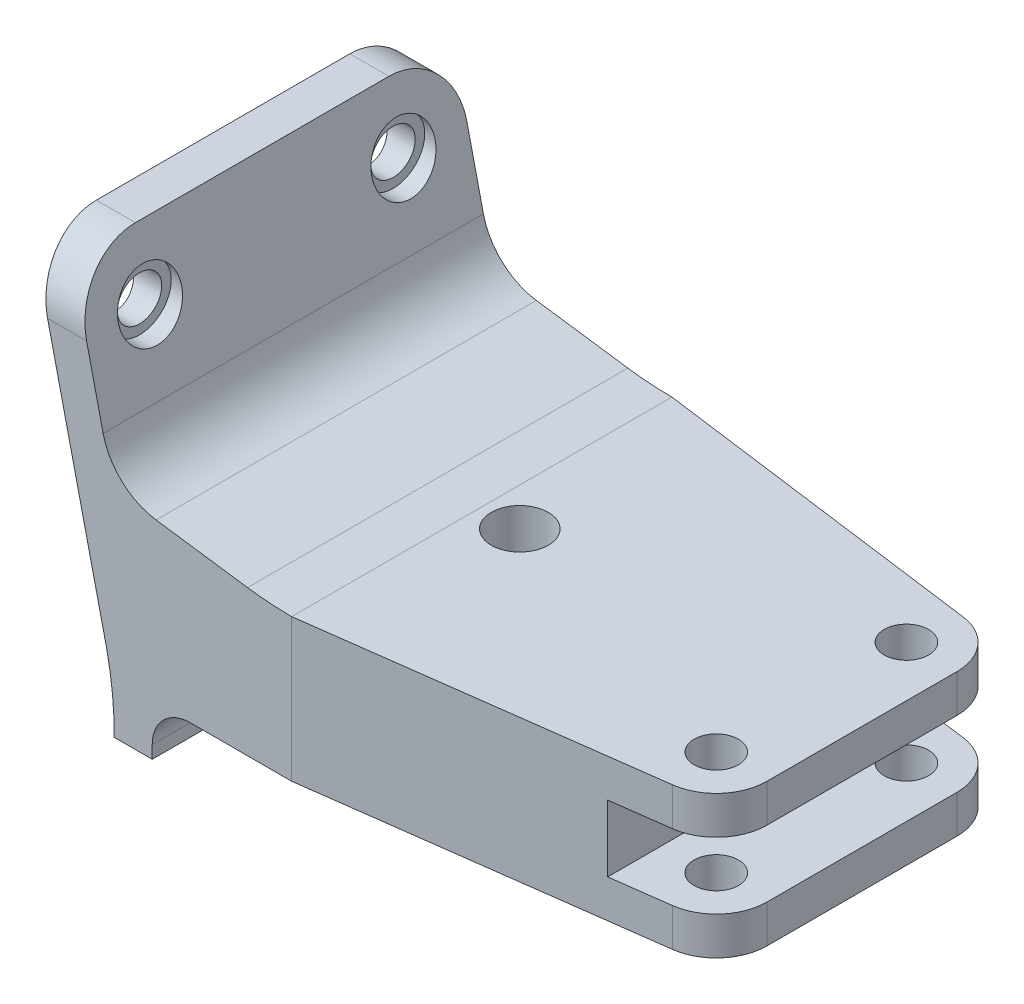
ISO-10303-21;
HEADER;
FILE_DESCRIPTION(('STEP AP214'),'2;1');
FILE_NAME('part.step','',(''),(''),'','','');
FILE_SCHEMA(('AUTOMOTIVE_DESIGN { 1 0 10303 214 1 1 1 1 }'));
ENDSEC;
DATA;
#1=APPLICATION_CONTEXT('core data for automotive mechanical design processes');
#2=APPLICATION_PROTOCOL_DEFINITION('international standard','automotive_design',2000,#1);
#3=PRODUCT_CONTEXT('',#1,'mechanical');
#4=PRODUCT('Part','Part','',(#3));
#5=PRODUCT_RELATED_PRODUCT_CATEGORY('part','',(#4));
#6=PRODUCT_DEFINITION_FORMATION('','',#4);
#7=PRODUCT_DEFINITION_CONTEXT('part definition',#1,'design');
#8=PRODUCT_DEFINITION('design','',#6,#7);
#9=PRODUCT_DEFINITION_SHAPE('','',#8);
#10=(LENGTH_UNIT() NAMED_UNIT(*) SI_UNIT(.MILLI.,.METRE.));
#11=(NAMED_UNIT(*) PLANE_ANGLE_UNIT() SI_UNIT($,.RADIAN.));
#12=(NAMED_UNIT(*) SI_UNIT($,.STERADIAN.) SOLID_ANGLE_UNIT());
#13=UNCERTAINTY_MEASURE_WITH_UNIT(LENGTH_MEASURE(1.E-05),#10,'distance_accuracy_value','');
#14=(GEOMETRIC_REPRESENTATION_CONTEXT(3) GLOBAL_UNCERTAINTY_ASSIGNED_CONTEXT((#13)) GLOBAL_UNIT_ASSIGNED_CONTEXT((#10,
#11,#12)) REPRESENTATION_CONTEXT('',''));
#15=CARTESIAN_POINT('',(0.,0.,0.));
#16=DIRECTION('',(0.,0.,1.));
#17=DIRECTION('',(1.,0.,0.));
#18=AXIS2_PLACEMENT_3D('',#15,#16,#17);
#19=CARTESIAN_POINT('',(19.3601182850422,25.75,10.));
#20=DIRECTION('',(1.,0.,0.));
#21=DIRECTION('',(0.,0.,-1.));
#22=AXIS2_PLACEMENT_3D('',#19,#20,#21);
#23=CYLINDRICAL_SURFACE('',#22,1.75);
#24=CARTESIAN_POINT('',(20.7432435592768,25.75,10.));
#25=DIRECTION('',(0.974444192149769,0.224629731748904,0.));
#26=DIRECTION('',(0.224629731748904,-0.974444192149769,0.));
#27=AXIS2_PLACEMENT_3D('',#24,#25,#26);
#28=ELLIPSE('',#27,1.79589556189897,1.75);
#29=CARTESIAN_POINT('',(21.1466550975952,24.,10.));
#30=VERTEX_POINT('',#29);
#31=EDGE_CURVE('E235',#30,#30,#28,.T.);
#32=ORIENTED_EDGE('',*,*,#31,.F.);
#33=EDGE_LOOP('',(#32));
#34=FACE_BOUND('',#33,.T.);
#35=CARTESIAN_POINT('',(23.,25.75,10.));
#36=DIRECTION('',(1.,0.,0.));
#37=DIRECTION('',(0.,0.,-1.));
#38=AXIS2_PLACEMENT_3D('',#35,#36,#37);
#39=CIRCLE('',#38,1.75);
#40=CARTESIAN_POINT('',(23.,25.75,8.25));
#41=VERTEX_POINT('',#40);
#42=EDGE_CURVE('E422',#41,#41,#39,.F.);
#43=ORIENTED_EDGE('',*,*,#42,.F.);
#44=EDGE_LOOP('',(#43));
#45=FACE_BOUND('',#44,.T.);
#46=ADVANCED_FACE('F33',(#34,#45),#23,.F.);
#47=CARTESIAN_POINT('',(25.1277790392512,20.0851882948513,15.));
#48=DIRECTION('',(-0.974444192149769,-0.224629731748903,0.));
#49=DIRECTION('',(0.224629731748903,-0.974444192149769,0.));
#50=AXIS2_PLACEMENT_3D('',#47,#48,#49);
#51=PLANE('',#50);
#52=CARTESIAN_POINT('',(23.8219216653893,25.75,-10.));
#53=DIRECTION('',(-0.974444192149769,-0.224629731748903,0.));
#54=DIRECTION('',(0.224629731748903,-0.974444192149769,0.));
#55=AXIS2_PLACEMENT_3D('',#52,#53,#54);
#56=ELLIPSE('',#55,2.5655650884271,2.5);
#57=CARTESIAN_POINT('',(24.3982238629871,23.25,-10.));
#58=VERTEX_POINT('',#57);
#59=EDGE_CURVE('E37',#58,#58,#56,.T.);
#60=ORIENTED_EDGE('',*,*,#59,.T.);
#61=EDGE_LOOP('',(#60));
#62=FACE_BOUND('',#61,.T.);
#63=CARTESIAN_POINT('',(23.8219216653893,25.75,10.));
#64=DIRECTION('',(-0.974444192149769,-0.224629731748903,0.));
#65=DIRECTION('',(0.224629731748903,-0.974444192149769,0.));
#66=AXIS2_PLACEMENT_3D('',#63,#64,#65);
#67=ELLIPSE('',#66,2.5655650884271,2.5);
#68=CARTESIAN_POINT('',(24.3982238629871,23.25,10.));
#69=VERTEX_POINT('',#68);
#70=EDGE_CURVE('E425',#69,#69,#67,.T.);
#71=ORIENTED_EDGE('',*,*,#70,.T.);
#72=EDGE_LOOP('',(#71));
#73=FACE_BOUND('',#72,.T.);
#74=DIRECTION('',(-0.224629731748903,0.974444192149769,0.));
#75=VECTOR('',#74,1.);
#76=CARTESIAN_POINT('',(25.1277790392512,20.0851882948513,-15.));
#77=LINE('',#76,#75);
#78=CARTESIAN_POINT('',(25.1277790392512,20.0851882948513,-15.));
#79=VERTEX_POINT('',#78);
#80=CARTESIAN_POINT('',(23.8219216653893,25.75,-15.));
#81=VERTEX_POINT('',#80);
#82=EDGE_CURVE('E364',#79,#81,#77,.T.);
#83=ORIENTED_EDGE('',*,*,#82,.T.);
#84=CARTESIAN_POINT('',(23.8219216653893,25.75,-10.));
#85=DIRECTION('',(-0.974444192149769,-0.224629731748903,0.));
#86=DIRECTION('',(0.224629731748903,-0.974444192149769,0.));
#87=AXIS2_PLACEMENT_3D('',#84,#85,#86);
#88=ELLIPSE('',#87,5.13113017685421,5.);
#89=CARTESIAN_POINT('',(22.6693172701939,30.75,-10.));
#90=VERTEX_POINT('',#89);
#91=EDGE_CURVE('E50',#81,#90,#88,.F.);
#92=ORIENTED_EDGE('',*,*,#91,.T.);
#93=DIRECTION('',(0.,0.,1.));
#94=VECTOR('',#93,1.);
#95=CARTESIAN_POINT('',(22.6693172701939,30.75,15.));
#96=LINE('',#95,#94);
#97=CARTESIAN_POINT('',(22.6693172701939,30.75,10.));
#98=VERTEX_POINT('',#97);
#99=EDGE_CURVE('E209',#90,#98,#96,.T.);
#100=ORIENTED_EDGE('',*,*,#99,.T.);
#101=CARTESIAN_POINT('',(23.8219216653893,25.75,10.));
#102=DIRECTION('',(-0.974444192149769,-0.224629731748903,0.));
#103=DIRECTION('',(0.224629731748903,-0.974444192149769,0.));
#104=AXIS2_PLACEMENT_3D('',#101,#102,#103);
#105=ELLIPSE('',#104,5.13113017685421,5.);
#106=CARTESIAN_POINT('',(23.8219216653893,25.75,15.));
#107=VERTEX_POINT('',#106);
#108=EDGE_CURVE('E220',#98,#107,#105,.F.);
#109=ORIENTED_EDGE('',*,*,#108,.T.);
#110=DIRECTION('',(-0.224629731748903,0.974444192149769,0.));
#111=VECTOR('',#110,1.);
#112=CARTESIAN_POINT('',(25.1277790392512,20.0851882948513,15.));
#113=LINE('',#112,#111);
#114=CARTESIAN_POINT('',(25.1277790392512,20.0851882948513,15.));
#115=VERTEX_POINT('',#114);
#116=EDGE_CURVE('E342',#115,#107,#113,.T.);
#117=ORIENTED_EDGE('',*,*,#116,.F.);
#118=DIRECTION('',(0.,0.,-1.));
#119=VECTOR('',#118,1.);
#120=CARTESIAN_POINT('',(25.1277790392512,20.0851882948513,15.));
#121=LINE('',#120,#119);
#122=EDGE_CURVE('E370',#115,#79,#121,.T.);
#123=ORIENTED_EDGE('',*,*,#122,.T.);
#124=EDGE_LOOP('',(#83,#92,#100,#109,#117,#123));
#125=FACE_BOUND('',#124,.T.);
#126=ADVANCED_FACE('F442',(#62,#73,#125),#51,.F.);
#127=CARTESIAN_POINT('',(0.,0.,15.));
#128=DIRECTION('',(0.,0.,1.));
#129=DIRECTION('',(1.,0.,0.));
#130=AXIS2_PLACEMENT_3D('',#127,#128,#129);
#131=PLANE('',#130);
#132=ORIENTED_EDGE('',*,*,#116,.T.);
#133=DIRECTION('',(1.,0.,0.));
#134=VECTOR('',#133,1.);
#135=CARTESIAN_POINT('',(19.3601182850422,25.75,15.));
#136=LINE('',#135,#134);
#137=CARTESIAN_POINT('',(20.7432435592768,25.75,15.));
#138=VERTEX_POINT('',#137);
#139=EDGE_CURVE('E42',#107,#138,#136,.F.);
#140=ORIENTED_EDGE('',*,*,#139,.T.);
#141=DIRECTION('',(0.224629731748904,-0.974444192149769,0.));
#142=VECTOR('',#141,1.);
#143=CARTESIAN_POINT('',(25.416367975422,5.47797763211434,15.));
#144=LINE('',#143,#142);
#145=CARTESIAN_POINT('',(25.416367975422,5.47797763211434,15.));
#146=VERTEX_POINT('',#145);
#147=EDGE_CURVE('E217',#138,#146,#144,.T.);
#148=ORIENTED_EDGE('',*,*,#147,.T.);
#149=CARTESIAN_POINT('',(0.,0.,15.));
#150=DIRECTION('',(0.,0.,-1.));
#151=DIRECTION('',(1.,0.,0.));
#152=AXIS2_PLACEMENT_3D('',#149,#150,#151);
#153=CIRCLE('',#152,26.);
#154=CARTESIAN_POINT('',(25.9987980491407,-0.25,15.));
#155=VERTEX_POINT('',#154);
#156=EDGE_CURVE('E323',#146,#155,#153,.T.);
#157=ORIENTED_EDGE('',*,*,#156,.T.);
#158=DIRECTION('',(1.,0.,0.));
#159=VECTOR('',#158,1.);
#160=CARTESIAN_POINT('',(25.9987980491407,-0.25,15.));
#161=LINE('',#160,#159);
#162=CARTESIAN_POINT('',(29.,-0.25,15.));
#163=VERTEX_POINT('',#162);
#164=EDGE_CURVE('E326',#155,#163,#161,.T.);
#165=ORIENTED_EDGE('',*,*,#164,.T.);
#166=DIRECTION('',(0.,1.,0.));
#167=VECTOR('',#166,1.);
#168=CARTESIAN_POINT('',(29.,0.749999999999999,15.));
#169=LINE('',#168,#167);
#170=CARTESIAN_POINT('',(29.,0.75,15.));
#171=VERTEX_POINT('',#170);
#172=EDGE_CURVE('E329',#163,#171,#169,.T.);
#173=ORIENTED_EDGE('',*,*,#172,.T.);
#174=CARTESIAN_POINT('',(32.,0.75,15.));
#175=DIRECTION('',(0.,0.,-1.));
#176=DIRECTION('',(1.,0.,0.));
#177=AXIS2_PLACEMENT_3D('',#174,#175,#176);
#178=CIRCLE('',#177,3.);
#179=CARTESIAN_POINT('',(32.,3.75,15.));
#180=VERTEX_POINT('',#179);
#181=EDGE_CURVE('E331',#171,#180,#178,.T.);
#182=ORIENTED_EDGE('',*,*,#181,.T.);
#183=DIRECTION('',(1.,0.,0.));
#184=VECTOR('',#183,1.);
#185=CARTESIAN_POINT('',(32.,3.75,15.));
#186=LINE('',#185,#184);
#187=CARTESIAN_POINT('',(40.,3.75,15.));
#188=VERTEX_POINT('',#187);
#189=EDGE_CURVE('E333',#180,#188,#186,.T.);
#190=ORIENTED_EDGE('',*,*,#189,.T.);
#191=DIRECTION('',(0.,-1.,0.));
#192=VECTOR('',#191,1.);
#193=CARTESIAN_POINT('',(40.,0.,15.));
#194=LINE('',#193,#192);
#195=CARTESIAN_POINT('',(40.,15.,15.));
#196=VERTEX_POINT('',#195);
#197=EDGE_CURVE('E414',#196,#188,#194,.T.);
#198=ORIENTED_EDGE('',*,*,#197,.F.);
#199=CARTESIAN_POINT('',(40.,40.,15.));
#200=DIRECTION('',(0.,0.,-1.));
#201=DIRECTION('',(1.,0.,0.));
#202=AXIS2_PLACEMENT_3D('',#199,#200,#201);
#203=CIRCLE('',#202,25.);
#204=CARTESIAN_POINT('',(36.5224214750842,15.2430525386702,15.));
#205=VERTEX_POINT('',#204);
#206=EDGE_CURVE('E336',#196,#205,#203,.T.);
#207=ORIENTED_EDGE('',*,*,#206,.T.);
#208=DIRECTION('',(-0.990277898453192,0.13910314099663,0.));
#209=VECTOR('',#208,1.);
#210=CARTESIAN_POINT('',(29.3044842950168,16.2569474613298,15.));
#211=LINE('',#210,#209);
#212=CARTESIAN_POINT('',(29.3044842950168,16.2569474613298,15.));
#213=VERTEX_POINT('',#212);
#214=EDGE_CURVE('E338',#205,#213,#211,.T.);
#215=ORIENTED_EDGE('',*,*,#214,.T.);
#216=CARTESIAN_POINT('',(30.,21.2083369535958,15.));
#217=DIRECTION('',(0.,0.,-1.));
#218=DIRECTION('',(-1.,0.,0.));
#219=AXIS2_PLACEMENT_3D('',#216,#217,#218);
#220=CIRCLE('',#219,5.);
#221=EDGE_CURVE('E340',#213,#115,#220,.T.);
#222=ORIENTED_EDGE('',*,*,#221,.T.);
#223=EDGE_LOOP('',(#132,#140,#148,#157,#165,#173,#182,#190,#198,#207,#215,#222));
#224=FACE_BOUND('',#223,.T.);
#225=ADVANCED_FACE('F455',(#224),#131,.T.);
#226=CARTESIAN_POINT('',(0.,0.,-15.));
#227=DIRECTION('',(0.,0.,1.));
#228=DIRECTION('',(1.,0.,0.));
#229=AXIS2_PLACEMENT_3D('',#226,#227,#228);
#230=PLANE('',#229);
#231=DIRECTION('',(1.,0.,0.));
#232=VECTOR('',#231,1.);
#233=CARTESIAN_POINT('',(19.3601182850422,25.75,-15.));
#234=LINE('',#233,#232);
#235=CARTESIAN_POINT('',(20.7432435592768,25.75,-15.));
#236=VERTEX_POINT('',#235);
#237=EDGE_CURVE('E200',#81,#236,#234,.F.);
#238=ORIENTED_EDGE('',*,*,#237,.F.);
#239=ORIENTED_EDGE('',*,*,#82,.F.);
#240=CARTESIAN_POINT('',(30.,21.2083369535958,-15.));
#241=DIRECTION('',(0.,0.,-1.));
#242=DIRECTION('',(-1.,0.,0.));
#243=AXIS2_PLACEMENT_3D('',#240,#241,#242);
#244=CIRCLE('',#243,5.);
#245=CARTESIAN_POINT('',(29.3044842950168,16.2569474613298,-15.));
#246=VERTEX_POINT('',#245);
#247=EDGE_CURVE('E362',#246,#79,#244,.T.);
#248=ORIENTED_EDGE('',*,*,#247,.F.);
#249=DIRECTION('',(-0.990277898453192,0.13910314099663,0.));
#250=VECTOR('',#249,1.);
#251=CARTESIAN_POINT('',(29.3044842950168,16.2569474613298,-15.));
#252=LINE('',#251,#250);
#253=CARTESIAN_POINT('',(36.5224214750842,15.2430525386702,-15.));
#254=VERTEX_POINT('',#253);
#255=EDGE_CURVE('E360',#254,#246,#252,.T.);
#256=ORIENTED_EDGE('',*,*,#255,.F.);
#257=CARTESIAN_POINT('',(40.,40.,-15.));
#258=DIRECTION('',(0.,0.,-1.));
#259=DIRECTION('',(1.,0.,0.));
#260=AXIS2_PLACEMENT_3D('',#257,#258,#259);
#261=CIRCLE('',#260,25.);
#262=CARTESIAN_POINT('',(40.,15.,-15.));
#263=VERTEX_POINT('',#262);
#264=EDGE_CURVE('E358',#263,#254,#261,.T.);
#265=ORIENTED_EDGE('',*,*,#264,.F.);
#266=DIRECTION('',(0.,-1.,0.));
#267=VECTOR('',#266,1.);
#268=CARTESIAN_POINT('',(40.,0.,-15.));
#269=LINE('',#268,#267);
#270=CARTESIAN_POINT('',(40.,3.75,-15.));
#271=VERTEX_POINT('',#270);
#272=EDGE_CURVE('E412',#263,#271,#269,.T.);
#273=ORIENTED_EDGE('',*,*,#272,.T.);
#274=DIRECTION('',(1.,0.,0.));
#275=VECTOR('',#274,1.);
#276=CARTESIAN_POINT('',(32.,3.75,-15.));
#277=LINE('',#276,#275);
#278=CARTESIAN_POINT('',(32.,3.75,-15.));
#279=VERTEX_POINT('',#278);
#280=EDGE_CURVE('E355',#279,#271,#277,.T.);
#281=ORIENTED_EDGE('',*,*,#280,.F.);
#282=CARTESIAN_POINT('',(32.,0.75,-15.));
#283=DIRECTION('',(0.,0.,-1.));
#284=DIRECTION('',(1.,0.,0.));
#285=AXIS2_PLACEMENT_3D('',#282,#283,#284);
#286=CIRCLE('',#285,3.);
#287=CARTESIAN_POINT('',(29.,0.75,-15.));
#288=VERTEX_POINT('',#287);
#289=EDGE_CURVE('E353',#288,#279,#286,.T.);
#290=ORIENTED_EDGE('',*,*,#289,.F.);
#291=DIRECTION('',(0.,1.,0.));
#292=VECTOR('',#291,1.);
#293=CARTESIAN_POINT('',(29.,0.749999999999999,-15.));
#294=LINE('',#293,#292);
#295=CARTESIAN_POINT('',(29.,-0.25,-15.));
#296=VERTEX_POINT('',#295);
#297=EDGE_CURVE('E351',#296,#288,#294,.T.);
#298=ORIENTED_EDGE('',*,*,#297,.F.);
#299=DIRECTION('',(1.,0.,0.));
#300=VECTOR('',#299,1.);
#301=CARTESIAN_POINT('',(25.9987980491407,-0.25,-15.));
#302=LINE('',#301,#300);
#303=CARTESIAN_POINT('',(25.9987980491407,-0.25,-15.));
#304=VERTEX_POINT('',#303);
#305=EDGE_CURVE('E349',#304,#296,#302,.T.);
#306=ORIENTED_EDGE('',*,*,#305,.F.);
#307=CARTESIAN_POINT('',(0.,0.,-15.));
#308=DIRECTION('',(0.,0.,-1.));
#309=DIRECTION('',(1.,0.,0.));
#310=AXIS2_PLACEMENT_3D('',#307,#308,#309);
#311=CIRCLE('',#310,26.);
#312=CARTESIAN_POINT('',(25.416367975422,5.47797763211434,-15.));
#313=VERTEX_POINT('',#312);
#314=EDGE_CURVE('E322',#313,#304,#311,.T.);
#315=ORIENTED_EDGE('',*,*,#314,.F.);
#316=DIRECTION('',(0.224629731748904,-0.974444192149769,0.));
#317=VECTOR('',#316,1.);
#318=CARTESIAN_POINT('',(25.416367975422,5.47797763211434,-15.));
#319=LINE('',#318,#317);
#320=EDGE_CURVE('E327',#236,#313,#319,.T.);
#321=ORIENTED_EDGE('',*,*,#320,.F.);
#322=EDGE_LOOP('',(#238,#239,#248,#256,#265,#273,#281,#290,#298,#306,#315,#321));
#323=FACE_BOUND('',#322,.T.);
#324=ADVANCED_FACE('F448',(#323),#230,.F.);
#325=CARTESIAN_POINT('',(70.,3.75,15.));
#326=DIRECTION('',(-1.,0.,0.));
#327=DIRECTION('',(0.,0.,1.));
#328=AXIS2_PLACEMENT_3D('',#325,#326,#327);
#329=PLANE('',#328);
#330=DIRECTION('',(0.,1.,0.));
#331=VECTOR('',#330,1.);
#332=CARTESIAN_POINT('',(70.,-0.25,-7.5));
#333=LINE('',#332,#331);
#334=CARTESIAN_POINT('',(70.,3.75,-7.5));
#335=VERTEX_POINT('',#334);
#336=CARTESIAN_POINT('',(70.,6.75,-7.5));
#337=VERTEX_POINT('',#336);
#338=EDGE_CURVE('E255',#335,#337,#333,.T.);
#339=ORIENTED_EDGE('',*,*,#338,.T.);
#340=DIRECTION('',(0.,0.,-1.));
#341=VECTOR('',#340,1.);
#342=CARTESIAN_POINT('',(70.,6.75,15.));
#343=LINE('',#342,#341);
#344=CARTESIAN_POINT('',(70.,6.75,7.5));
#345=VERTEX_POINT('',#344);
#346=EDGE_CURVE('E394',#345,#337,#343,.T.);
#347=ORIENTED_EDGE('',*,*,#346,.F.);
#348=DIRECTION('',(0.,1.,0.));
#349=VECTOR('',#348,1.);
#350=CARTESIAN_POINT('',(70.,-0.25,7.5));
#351=LINE('',#350,#349);
#352=CARTESIAN_POINT('',(70.,3.75,7.5));
#353=VERTEX_POINT('',#352);
#354=EDGE_CURVE('E245',#353,#345,#351,.T.);
#355=ORIENTED_EDGE('',*,*,#354,.F.);
#356=DIRECTION('',(0.,0.,-1.));
#357=VECTOR('',#356,1.);
#358=CARTESIAN_POINT('',(70.,3.75,15.));
#359=LINE('',#358,#357);
#360=EDGE_CURVE('E397',#353,#335,#359,.T.);
#361=ORIENTED_EDGE('',*,*,#360,.T.);
#362=EDGE_LOOP('',(#339,#347,#355,#361));
#363=FACE_BOUND('',#362,.T.);
#364=ADVANCED_FACE('F513',(#363),#329,.F.);
#365=CARTESIAN_POINT('',(70.,15.,15.));
#366=DIRECTION('',(-1.,0.,0.));
#367=DIRECTION('',(0.,0.,1.));
#368=AXIS2_PLACEMENT_3D('',#365,#366,#367);
#369=PLANE('',#368);
#370=CARTESIAN_POINT('',(70.,12.,-7.5));
#371=VERTEX_POINT('',#370);
#372=CARTESIAN_POINT('',(70.,15.,-7.5));
#373=VERTEX_POINT('',#372);
#374=EDGE_CURVE('E252',#371,#373,#333,.T.);
#375=ORIENTED_EDGE('',*,*,#374,.T.);
#376=DIRECTION('',(0.,0.,-1.));
#377=VECTOR('',#376,1.);
#378=CARTESIAN_POINT('',(70.,15.,15.));
#379=LINE('',#378,#377);
#380=CARTESIAN_POINT('',(70.,15.,7.5));
#381=VERTEX_POINT('',#380);
#382=EDGE_CURVE('E382',#381,#373,#379,.T.);
#383=ORIENTED_EDGE('',*,*,#382,.F.);
#384=CARTESIAN_POINT('',(70.,12.,7.5));
#385=VERTEX_POINT('',#384);
#386=EDGE_CURVE('E243',#385,#381,#351,.T.);
#387=ORIENTED_EDGE('',*,*,#386,.F.);
#388=DIRECTION('',(0.,0.,-1.));
#389=VECTOR('',#388,1.);
#390=CARTESIAN_POINT('',(70.,12.,15.));
#391=LINE('',#390,#389);
#392=EDGE_CURVE('E385',#385,#371,#391,.T.);
#393=ORIENTED_EDGE('',*,*,#392,.T.);
#394=EDGE_LOOP('',(#375,#383,#387,#393));
#395=FACE_BOUND('',#394,.T.);
#396=ADVANCED_FACE('F534',(#395),#369,.F.);
#397=CARTESIAN_POINT('',(0.,0.,15.));
#398=DIRECTION('',(0.,0.,-1.));
#399=DIRECTION('',(-1.,0.,0.));
#400=AXIS2_PLACEMENT_3D('',#397,#398,#399);
#401=CYLINDRICAL_SURFACE('',#400,26.);
#402=ORIENTED_EDGE('',*,*,#314,.T.);
#403=DIRECTION('',(0.,0.,-1.));
#404=VECTOR('',#403,1.);
#405=CARTESIAN_POINT('',(25.9987980491407,-0.25,15.));
#406=LINE('',#405,#404);
#407=EDGE_CURVE('E409',#155,#304,#406,.T.);
#408=ORIENTED_EDGE('',*,*,#407,.F.);
#409=ORIENTED_EDGE('',*,*,#156,.F.);
#410=DIRECTION('',(0.,0.,-1.));
#411=VECTOR('',#410,1.);
#412=CARTESIAN_POINT('',(25.416367975422,5.47797763211434,15.));
#413=LINE('',#412,#411);
#414=EDGE_CURVE('E346',#146,#313,#413,.T.);
#415=ORIENTED_EDGE('',*,*,#414,.T.);
#416=EDGE_LOOP('',(#402,#408,#409,#415));
#417=FACE_BOUND('',#416,.T.);
#418=ADVANCED_FACE('F35',(#417),#401,.F.);
#419=CARTESIAN_POINT('',(25.9987980491407,-0.25,15.));
#420=DIRECTION('',(0.,1.,0.));
#421=DIRECTION('',(0.,0.,1.));
#422=AXIS2_PLACEMENT_3D('',#419,#420,#421);
#423=PLANE('',#422);
#424=ORIENTED_EDGE('',*,*,#305,.T.);
#425=DIRECTION('',(0.,0.,-1.));
#426=VECTOR('',#425,1.);
#427=CARTESIAN_POINT('',(29.,-0.25,15.));
#428=LINE('',#427,#426);
#429=EDGE_CURVE('E406',#163,#296,#428,.T.);
#430=ORIENTED_EDGE('',*,*,#429,.F.);
#431=ORIENTED_EDGE('',*,*,#164,.F.);
#432=ORIENTED_EDGE('',*,*,#407,.T.);
#433=EDGE_LOOP('',(#424,#430,#431,#432));
#434=FACE_BOUND('',#433,.T.);
#435=ADVANCED_FACE('F562',(#434),#423,.F.);
#436=CARTESIAN_POINT('',(29.,0.749999999999999,15.));
#437=DIRECTION('',(-1.,0.,0.));
#438=DIRECTION('',(0.,0.,1.));
#439=AXIS2_PLACEMENT_3D('',#436,#437,#438);
#440=PLANE('',#439);
#441=ORIENTED_EDGE('',*,*,#297,.T.);
#442=DIRECTION('',(0.,0.,-1.));
#443=VECTOR('',#442,1.);
#444=CARTESIAN_POINT('',(29.,0.75,15.));
#445=LINE('',#444,#443);
#446=EDGE_CURVE('E403',#171,#288,#445,.T.);
#447=ORIENTED_EDGE('',*,*,#446,.F.);
#448=ORIENTED_EDGE('',*,*,#172,.F.);
#449=ORIENTED_EDGE('',*,*,#429,.T.);
#450=EDGE_LOOP('',(#441,#447,#448,#449));
#451=FACE_BOUND('',#450,.T.);
#452=ADVANCED_FACE('F559',(#451),#440,.F.);
#453=CARTESIAN_POINT('',(32.,0.75,15.));
#454=DIRECTION('',(0.,0.,-1.));
#455=DIRECTION('',(-1.,0.,0.));
#456=AXIS2_PLACEMENT_3D('',#453,#454,#455);
#457=CYLINDRICAL_SURFACE('',#456,3.);
#458=ORIENTED_EDGE('',*,*,#289,.T.);
#459=DIRECTION('',(0.,0.,-1.));
#460=VECTOR('',#459,1.);
#461=CARTESIAN_POINT('',(32.,3.75,15.));
#462=LINE('',#461,#460);
#463=EDGE_CURVE('E400',#180,#279,#462,.T.);
#464=ORIENTED_EDGE('',*,*,#463,.F.);
#465=ORIENTED_EDGE('',*,*,#181,.F.);
#466=ORIENTED_EDGE('',*,*,#446,.T.);
#467=EDGE_LOOP('',(#458,#464,#465,#466));
#468=FACE_BOUND('',#467,.T.);
#469=ADVANCED_FACE('F555',(#468),#457,.F.);
#470=CARTESIAN_POINT('',(32.,3.75,15.));
#471=DIRECTION('',(0.,1.,0.));
#472=DIRECTION('',(0.,0.,1.));
#473=AXIS2_PLACEMENT_3D('',#470,#471,#472);
#474=PLANE('',#473);
#475=CARTESIAN_POINT('',(43.,3.75,0.));
#476=DIRECTION('',(0.,1.,0.));
#477=DIRECTION('',(0.,0.,1.));
#478=AXIS2_PLACEMENT_3D('',#475,#476,#477);
#479=CIRCLE('',#478,2.25000000000002);
#480=CARTESIAN_POINT('',(43.,3.75,2.25000000000002));
#481=VERTEX_POINT('',#480);
#482=EDGE_CURVE('E307',#481,#481,#479,.T.);
#483=ORIENTED_EDGE('',*,*,#482,.T.);
#484=EDGE_LOOP('',(#483));
#485=FACE_BOUND('',#484,.T.);
#486=CARTESIAN_POINT('',(66.,3.75,7.5));
#487=DIRECTION('',(0.,1.,0.));
#488=DIRECTION('',(0.,0.,1.));
#489=AXIS2_PLACEMENT_3D('',#486,#487,#488);
#490=CIRCLE('',#489,1.75);
#491=CARTESIAN_POINT('',(66.,3.75,9.25));
#492=VERTEX_POINT('',#491);
#493=EDGE_CURVE('E304',#492,#492,#490,.T.);
#494=ORIENTED_EDGE('',*,*,#493,.T.);
#495=EDGE_LOOP('',(#494));
#496=FACE_BOUND('',#495,.T.);
#497=CARTESIAN_POINT('',(66.,3.75,-7.5));
#498=DIRECTION('',(0.,1.,0.));
#499=DIRECTION('',(0.,0.,1.));
#500=AXIS2_PLACEMENT_3D('',#497,#498,#499);
#501=CIRCLE('',#500,1.75);
#502=CARTESIAN_POINT('',(66.,3.75,-5.75));
#503=VERTEX_POINT('',#502);
#504=EDGE_CURVE('E319',#503,#503,#501,.T.);
#505=ORIENTED_EDGE('',*,*,#504,.T.);
#506=EDGE_LOOP('',(#505));
#507=FACE_BOUND('',#506,.T.);
#508=DIRECTION('',(0.991238008789044,0.,0.132087887150686));
#509=VECTOR('',#508,1.);
#510=CARTESIAN_POINT('',(36.0674937067874,3.75,-15.5240279759972));
#511=LINE('',#510,#509);
#512=CARTESIAN_POINT('',(66.5283515486027,3.75,-11.4649520351562));
#513=VERTEX_POINT('',#512);
#514=EDGE_CURVE('E58',#271,#513,#511,.T.);
#515=ORIENTED_EDGE('',*,*,#514,.T.);
#516=CARTESIAN_POINT('',(66.,3.75,-7.5));
#517=DIRECTION('',(0.,1.,0.));
#518=DIRECTION('',(0.,0.,1.));
#519=AXIS2_PLACEMENT_3D('',#516,#517,#518);
#520=CIRCLE('',#519,4.);
#521=EDGE_CURVE('E295',#513,#335,#520,.F.);
#522=ORIENTED_EDGE('',*,*,#521,.T.);
#523=ORIENTED_EDGE('',*,*,#360,.F.);
#524=CARTESIAN_POINT('',(66.,3.75,7.5));
#525=DIRECTION('',(0.,1.,0.));
#526=DIRECTION('',(0.,0.,1.));
#527=AXIS2_PLACEMENT_3D('',#524,#525,#526);
#528=CIRCLE('',#527,4.);
#529=CARTESIAN_POINT('',(66.5283515486027,3.75,11.4649520351562));
#530=VERTEX_POINT('',#529);
#531=EDGE_CURVE('E286',#353,#530,#528,.F.);
#532=ORIENTED_EDGE('',*,*,#531,.T.);
#533=DIRECTION('',(-0.991238008789044,0.,0.132087887150686));
#534=VECTOR('',#533,1.);
#535=CARTESIAN_POINT('',(32.1395776794554,3.75,16.0474442739552));
#536=LINE('',#535,#534);
#537=EDGE_CURVE('E277',#530,#188,#536,.T.);
#538=ORIENTED_EDGE('',*,*,#537,.T.);
#539=ORIENTED_EDGE('',*,*,#189,.F.);
#540=ORIENTED_EDGE('',*,*,#463,.T.);
#541=ORIENTED_EDGE('',*,*,#280,.T.);
#542=EDGE_LOOP('',(#515,#522,#523,#532,#538,#539,#540,#541));
#543=FACE_BOUND('',#542,.T.);
#544=ADVANCED_FACE('F548',(#485,#496,#507,#543),#474,.F.);
#545=CARTESIAN_POINT('',(70.,6.75,15.));
#546=DIRECTION('',(0.,-1.,0.));
#547=DIRECTION('',(0.,0.,-1.));
#548=AXIS2_PLACEMENT_3D('',#545,#546,#547);
#549=PLANE('',#548);
#550=CARTESIAN_POINT('',(66.,6.75,7.5));
#551=DIRECTION('',(0.,-1.,0.));
#552=DIRECTION('',(0.,0.,-1.));
#553=AXIS2_PLACEMENT_3D('',#550,#551,#552);
#554=CIRCLE('',#553,1.75);
#555=CARTESIAN_POINT('',(66.,6.75,5.75));
#556=VERTEX_POINT('',#555);
#557=EDGE_CURVE('E301',#556,#556,#554,.T.);
#558=ORIENTED_EDGE('',*,*,#557,.T.);
#559=EDGE_LOOP('',(#558));
#560=FACE_BOUND('',#559,.T.);
#561=CARTESIAN_POINT('',(66.,6.75,-7.5));
#562=DIRECTION('',(0.,-1.,0.));
#563=DIRECTION('',(0.,0.,-1.));
#564=AXIS2_PLACEMENT_3D('',#561,#562,#563);
#565=CIRCLE('',#564,1.75);
#566=CARTESIAN_POINT('',(66.,6.75,-9.25));
#567=VERTEX_POINT('',#566);
#568=EDGE_CURVE('E316',#567,#567,#565,.T.);
#569=ORIENTED_EDGE('',*,*,#568,.T.);
#570=EDGE_LOOP('',(#569));
#571=FACE_BOUND('',#570,.T.);
#572=ORIENTED_EDGE('',*,*,#346,.T.);
#573=CARTESIAN_POINT('',(66.,6.75,-7.5));
#574=DIRECTION('',(0.,-1.,0.));
#575=DIRECTION('',(0.,0.,-1.));
#576=AXIS2_PLACEMENT_3D('',#573,#574,#575);
#577=CIRCLE('',#576,4.);
#578=CARTESIAN_POINT('',(66.5283515486027,6.75,-11.4649520351562));
#579=VERTEX_POINT('',#578);
#580=EDGE_CURVE('E292',#337,#579,#577,.F.);
#581=ORIENTED_EDGE('',*,*,#580,.T.);
#582=DIRECTION('',(-0.991238008789044,0.,-0.132087887150686));
#583=VECTOR('',#582,1.);
#584=CARTESIAN_POINT('',(73.404499729374,6.75,-10.5486676747101));
#585=LINE('',#584,#583);
#586=CARTESIAN_POINT('',(62.,6.75,-12.0683796509527));
#587=VERTEX_POINT('',#586);
#588=EDGE_CURVE('E264',#579,#587,#585,.T.);
#589=ORIENTED_EDGE('',*,*,#588,.T.);
#590=DIRECTION('',(0.,0.,-1.));
#591=VECTOR('',#590,1.);
#592=CARTESIAN_POINT('',(62.,6.75,15.));
#593=LINE('',#592,#591);
#594=CARTESIAN_POINT('',(62.,6.75,12.0683796509527));
#595=VERTEX_POINT('',#594);
#596=EDGE_CURVE('E391',#595,#587,#593,.T.);
#597=ORIENTED_EDGE('',*,*,#596,.F.);
#598=DIRECTION('',(0.991238008789044,0.,-0.132087887150686));
#599=VECTOR('',#598,1.);
#600=CARTESIAN_POINT('',(69.476583702042,6.75,11.0720839726681));
#601=LINE('',#600,#599);
#602=CARTESIAN_POINT('',(66.5283515486027,6.75,11.4649520351562));
#603=VERTEX_POINT('',#602);
#604=EDGE_CURVE('E274',#595,#603,#601,.T.);
#605=ORIENTED_EDGE('',*,*,#604,.T.);
#606=CARTESIAN_POINT('',(66.,6.75,7.5));
#607=DIRECTION('',(0.,-1.,0.));
#608=DIRECTION('',(0.,0.,-1.));
#609=AXIS2_PLACEMENT_3D('',#606,#607,#608);
#610=CIRCLE('',#609,4.);
#611=EDGE_CURVE('E283',#603,#345,#610,.F.);
#612=ORIENTED_EDGE('',*,*,#611,.T.);
#613=EDGE_LOOP('',(#572,#581,#589,#597,#605,#612));
#614=FACE_BOUND('',#613,.T.);
#615=ADVANCED_FACE('F544',(#560,#571,#614),#549,.F.);
#616=CARTESIAN_POINT('',(62.,12.,15.));
#617=DIRECTION('',(-1.,0.,0.));
#618=DIRECTION('',(0.,0.,1.));
#619=AXIS2_PLACEMENT_3D('',#616,#617,#618);
#620=PLANE('',#619);
#621=ORIENTED_EDGE('',*,*,#596,.T.);
#622=DIRECTION('',(0.,1.,0.));
#623=VECTOR('',#622,1.);
#624=CARTESIAN_POINT('',(62.,12.,-12.0683796509527));
#625=LINE('',#624,#623);
#626=CARTESIAN_POINT('',(62.,12.,-12.0683796509527));
#627=VERTEX_POINT('',#626);
#628=EDGE_CURVE('E261',#587,#627,#625,.T.);
#629=ORIENTED_EDGE('',*,*,#628,.T.);
#630=DIRECTION('',(0.,0.,-1.));
#631=VECTOR('',#630,1.);
#632=CARTESIAN_POINT('',(62.,12.,15.));
#633=LINE('',#632,#631);
#634=CARTESIAN_POINT('',(62.,12.,12.0683796509527));
#635=VERTEX_POINT('',#634);
#636=EDGE_CURVE('E388',#635,#627,#633,.T.);
#637=ORIENTED_EDGE('',*,*,#636,.F.);
#638=DIRECTION('',(0.,-1.,0.));
#639=VECTOR('',#638,1.);
#640=CARTESIAN_POINT('',(62.,12.,12.0683796509527));
#641=LINE('',#640,#639);
#642=EDGE_CURVE('E271',#635,#595,#641,.T.);
#643=ORIENTED_EDGE('',*,*,#642,.T.);
#644=EDGE_LOOP('',(#621,#629,#637,#643));
#645=FACE_BOUND('',#644,.T.);
#646=ADVANCED_FACE('F540',(#645),#620,.F.);
#647=CARTESIAN_POINT('',(70.,12.,15.));
#648=DIRECTION('',(0.,1.,0.));
#649=DIRECTION('',(0.,0.,1.));
#650=AXIS2_PLACEMENT_3D('',#647,#648,#649);
#651=PLANE('',#650);
#652=CARTESIAN_POINT('',(66.,12.,7.5));
#653=DIRECTION('',(0.,1.,0.));
#654=DIRECTION('',(0.,0.,1.));
#655=AXIS2_PLACEMENT_3D('',#652,#653,#654);
#656=CIRCLE('',#655,1.75);
#657=CARTESIAN_POINT('',(66.,12.,9.25));
#658=VERTEX_POINT('',#657);
#659=EDGE_CURVE('E298',#658,#658,#656,.T.);
#660=ORIENTED_EDGE('',*,*,#659,.T.);
#661=EDGE_LOOP('',(#660));
#662=FACE_BOUND('',#661,.T.);
#663=CARTESIAN_POINT('',(66.,12.,-7.5));
#664=DIRECTION('',(0.,1.,0.));
#665=DIRECTION('',(0.,0.,1.));
#666=AXIS2_PLACEMENT_3D('',#663,#664,#665);
#667=CIRCLE('',#666,1.75);
#668=CARTESIAN_POINT('',(66.,12.,-5.75));
#669=VERTEX_POINT('',#668);
#670=EDGE_CURVE('E313',#669,#669,#667,.T.);
#671=ORIENTED_EDGE('',*,*,#670,.T.);
#672=EDGE_LOOP('',(#671));
#673=FACE_BOUND('',#672,.T.);
#674=DIRECTION('',(0.991238008789044,0.,0.132087887150686));
#675=VECTOR('',#674,1.);
#676=CARTESIAN_POINT('',(73.404499729374,12.,-10.5486676747101));
#677=LINE('',#676,#675);
#678=CARTESIAN_POINT('',(66.5283515486027,12.,-11.4649520351562));
#679=VERTEX_POINT('',#678);
#680=EDGE_CURVE('E258',#627,#679,#677,.T.);
#681=ORIENTED_EDGE('',*,*,#680,.T.);
#682=CARTESIAN_POINT('',(66.,12.,-7.5));
#683=DIRECTION('',(0.,1.,0.));
#684=DIRECTION('',(0.,0.,1.));
#685=AXIS2_PLACEMENT_3D('',#682,#683,#684);
#686=CIRCLE('',#685,4.);
#687=EDGE_CURVE('E289',#679,#371,#686,.F.);
#688=ORIENTED_EDGE('',*,*,#687,.T.);
#689=ORIENTED_EDGE('',*,*,#392,.F.);
#690=CARTESIAN_POINT('',(66.,12.,7.5));
#691=DIRECTION('',(0.,1.,0.));
#692=DIRECTION('',(0.,0.,1.));
#693=AXIS2_PLACEMENT_3D('',#690,#691,#692);
#694=CIRCLE('',#693,4.);
#695=CARTESIAN_POINT('',(66.5283515486027,12.,11.4649520351562));
#696=VERTEX_POINT('',#695);
#697=EDGE_CURVE('E280',#385,#696,#694,.F.);
#698=ORIENTED_EDGE('',*,*,#697,.T.);
#699=DIRECTION('',(-0.991238008789044,0.,0.132087887150686));
#700=VECTOR('',#699,1.);
#701=CARTESIAN_POINT('',(69.476583702042,12.,11.0720839726681));
#702=LINE('',#701,#700);
#703=EDGE_CURVE('E268',#696,#635,#702,.T.);
#704=ORIENTED_EDGE('',*,*,#703,.T.);
#705=ORIENTED_EDGE('',*,*,#636,.T.);
#706=EDGE_LOOP('',(#681,#688,#689,#698,#704,#705));
#707=FACE_BOUND('',#706,.T.);
#708=ADVANCED_FACE('F532',(#662,#673,#707),#651,.F.);
#709=CARTESIAN_POINT('',(40.,15.,15.));
#710=DIRECTION('',(0.,-1.,0.));
#711=DIRECTION('',(0.,0.,-1.));
#712=AXIS2_PLACEMENT_3D('',#709,#710,#711);
#713=PLANE('',#712);
#714=CARTESIAN_POINT('',(43.,15.,0.));
#715=DIRECTION('',(0.,1.,0.));
#716=DIRECTION('',(0.,0.,1.));
#717=AXIS2_PLACEMENT_3D('',#714,#715,#716);
#718=CIRCLE('',#717,2.25000000000002);
#719=CARTESIAN_POINT('',(43.,15.,2.25000000000002));
#720=VERTEX_POINT('',#719);
#721=EDGE_CURVE('E232',#720,#720,#718,.T.);
#722=ORIENTED_EDGE('',*,*,#721,.F.);
#723=EDGE_LOOP('',(#722));
#724=FACE_BOUND('',#723,.T.);
#725=CARTESIAN_POINT('',(66.,15.,7.5));
#726=DIRECTION('',(0.,1.,0.));
#727=DIRECTION('',(0.,0.,-1.));
#728=AXIS2_PLACEMENT_3D('',#725,#726,#727);
#729=CIRCLE('',#728,1.75);
#730=CARTESIAN_POINT('',(66.,15.,5.75));
#731=VERTEX_POINT('',#730);
#732=EDGE_CURVE('E228',#731,#731,#729,.T.);
#733=ORIENTED_EDGE('',*,*,#732,.F.);
#734=EDGE_LOOP('',(#733));
#735=FACE_BOUND('',#734,.T.);
#736=CARTESIAN_POINT('',(66.,15.,-7.5));
#737=DIRECTION('',(0.,1.,0.));
#738=DIRECTION('',(0.,0.,1.));
#739=AXIS2_PLACEMENT_3D('',#736,#737,#738);
#740=CIRCLE('',#739,1.75);
#741=CARTESIAN_POINT('',(66.,15.,-5.75));
#742=VERTEX_POINT('',#741);
#743=EDGE_CURVE('E310',#742,#742,#740,.T.);
#744=ORIENTED_EDGE('',*,*,#743,.F.);
#745=EDGE_LOOP('',(#744));
#746=FACE_BOUND('',#745,.T.);
#747=ORIENTED_EDGE('',*,*,#382,.T.);
#748=CARTESIAN_POINT('',(66.,15.,-7.5));
#749=DIRECTION('',(0.,-1.,0.));
#750=DIRECTION('',(0.,0.,1.));
#751=AXIS2_PLACEMENT_3D('',#748,#749,#750);
#752=CIRCLE('',#751,4.);
#753=CARTESIAN_POINT('',(66.5283515486027,15.,-11.4649520351562));
#754=VERTEX_POINT('',#753);
#755=EDGE_CURVE('E231',#754,#373,#752,.T.);
#756=ORIENTED_EDGE('',*,*,#755,.F.);
#757=DIRECTION('',(0.991238008789043,0.,0.132087887150686));
#758=VECTOR('',#757,1.);
#759=CARTESIAN_POINT('',(40.,15.,-15.));
#760=LINE('',#759,#758);
#761=EDGE_CURVE('E249',#263,#754,#760,.T.);
#762=ORIENTED_EDGE('',*,*,#761,.F.);
#763=DIRECTION('',(0.,0.,-1.));
#764=VECTOR('',#763,1.);
#765=CARTESIAN_POINT('',(40.,15.,15.));
#766=LINE('',#765,#764);
#767=EDGE_CURVE('E379',#196,#263,#766,.T.);
#768=ORIENTED_EDGE('',*,*,#767,.F.);
#769=DIRECTION('',(-0.991238008789043,0.,0.132087887150686));
#770=VECTOR('',#769,1.);
#771=CARTESIAN_POINT('',(40.,15.,15.));
#772=LINE('',#771,#770);
#773=CARTESIAN_POINT('',(66.5283515486027,15.,11.4649520351562));
#774=VERTEX_POINT('',#773);
#775=EDGE_CURVE('E239',#774,#196,#772,.T.);
#776=ORIENTED_EDGE('',*,*,#775,.F.);
#777=CARTESIAN_POINT('',(66.,15.,7.5));
#778=DIRECTION('',(0.,-1.,0.));
#779=DIRECTION('',(0.,0.,-1.));
#780=AXIS2_PLACEMENT_3D('',#777,#778,#779);
#781=CIRCLE('',#780,4.);
#782=EDGE_CURVE('E236',#381,#774,#781,.T.);
#783=ORIENTED_EDGE('',*,*,#782,.F.);
#784=EDGE_LOOP('',(#747,#756,#762,#768,#776,#783));
#785=FACE_BOUND('',#784,.T.);
#786=ADVANCED_FACE('F528',(#724,#735,#746,#785),#713,.F.);
#787=CARTESIAN_POINT('',(40.,40.,15.));
#788=DIRECTION('',(0.,0.,-1.));
#789=DIRECTION('',(-1.,0.,0.));
#790=AXIS2_PLACEMENT_3D('',#787,#788,#789);
#791=CYLINDRICAL_SURFACE('',#790,25.);
#792=ORIENTED_EDGE('',*,*,#264,.T.);
#793=DIRECTION('',(0.,0.,-1.));
#794=VECTOR('',#793,1.);
#795=CARTESIAN_POINT('',(36.5224214750842,15.2430525386702,15.));
#796=LINE('',#795,#794);
#797=EDGE_CURVE('E376',#205,#254,#796,.T.);
#798=ORIENTED_EDGE('',*,*,#797,.F.);
#799=ORIENTED_EDGE('',*,*,#206,.F.);
#800=ORIENTED_EDGE('',*,*,#767,.T.);
#801=EDGE_LOOP('',(#792,#798,#799,#800));
#802=FACE_BOUND('',#801,.T.);
#803=ADVANCED_FACE('F524',(#802),#791,.F.);
#804=CARTESIAN_POINT('',(29.3044842950168,16.2569474613298,15.));
#805=DIRECTION('',(-0.13910314099663,-0.990277898453192,0.));
#806=DIRECTION('',(0.990277898453193,-0.13910314099663,0.));
#807=AXIS2_PLACEMENT_3D('',#804,#805,#806);
#808=PLANE('',#807);
#809=ORIENTED_EDGE('',*,*,#255,.T.);
#810=DIRECTION('',(0.,0.,-1.));
#811=VECTOR('',#810,1.);
#812=CARTESIAN_POINT('',(29.3044842950168,16.2569474613298,15.));
#813=LINE('',#812,#811);
#814=EDGE_CURVE('E373',#213,#246,#813,.T.);
#815=ORIENTED_EDGE('',*,*,#814,.F.);
#816=ORIENTED_EDGE('',*,*,#214,.F.);
#817=ORIENTED_EDGE('',*,*,#797,.T.);
#818=EDGE_LOOP('',(#809,#815,#816,#817));
#819=FACE_BOUND('',#818,.T.);
#820=ADVANCED_FACE('F520',(#819),#808,.F.);
#821=CARTESIAN_POINT('',(30.,21.2083369535958,15.));
#822=DIRECTION('',(0.,0.,-1.));
#823=DIRECTION('',(-1.,0.,0.));
#824=AXIS2_PLACEMENT_3D('',#821,#822,#823);
#825=CYLINDRICAL_SURFACE('',#824,5.);
#826=ORIENTED_EDGE('',*,*,#247,.T.);
#827=ORIENTED_EDGE('',*,*,#122,.F.);
#828=ORIENTED_EDGE('',*,*,#221,.F.);
#829=ORIENTED_EDGE('',*,*,#814,.T.);
#830=EDGE_LOOP('',(#826,#827,#828,#829));
#831=FACE_BOUND('',#830,.T.);
#832=ADVANCED_FACE('F515',(#831),#825,.F.);
#833=CARTESIAN_POINT('',(25.416367975422,5.47797763211434,15.));
#834=DIRECTION('',(0.974444192149769,0.224629731748904,0.));
#835=DIRECTION('',(-0.224629731748904,0.974444192149769,0.));
#836=AXIS2_PLACEMENT_3D('',#833,#834,#835);
#837=PLANE('',#836);
#838=CARTESIAN_POINT('',(20.7432435592768,25.75,-10.));
#839=DIRECTION('',(0.974444192149769,0.224629731748904,0.));
#840=DIRECTION('',(0.224629731748904,-0.974444192149769,0.));
#841=AXIS2_PLACEMENT_3D('',#838,#839,#840);
#842=ELLIPSE('',#841,1.79589556189897,1.75);
#843=CARTESIAN_POINT('',(21.1466550975952,24.,-10.));
#844=VERTEX_POINT('',#843);
#845=EDGE_CURVE('E227',#844,#844,#842,.T.);
#846=ORIENTED_EDGE('',*,*,#845,.T.);
#847=EDGE_LOOP('',(#846));
#848=FACE_BOUND('',#847,.T.);
#849=ORIENTED_EDGE('',*,*,#31,.T.);
#850=EDGE_LOOP('',(#849));
#851=FACE_BOUND('',#850,.T.);
#852=DIRECTION('',(0.,0.,-1.));
#853=VECTOR('',#852,1.);
#854=CARTESIAN_POINT('',(19.5906391640813,30.75,15.));
#855=LINE('',#854,#853);
#856=CARTESIAN_POINT('',(19.5906391640813,30.75,10.));
#857=VERTEX_POINT('',#856);
#858=CARTESIAN_POINT('',(19.5906391640813,30.75,-10.));
#859=VERTEX_POINT('',#858);
#860=EDGE_CURVE('E11',#857,#859,#855,.T.);
#861=ORIENTED_EDGE('',*,*,#860,.T.);
#862=CARTESIAN_POINT('',(20.7432435592768,25.75,-10.));
#863=DIRECTION('',(0.974444192149769,0.224629731748904,0.));
#864=DIRECTION('',(0.224629731748904,-0.974444192149769,0.));
#865=AXIS2_PLACEMENT_3D('',#862,#863,#864);
#866=ELLIPSE('',#865,5.13113017685421,5.);
#867=EDGE_CURVE('E196',#859,#236,#866,.F.);
#868=ORIENTED_EDGE('',*,*,#867,.T.);
#869=ORIENTED_EDGE('',*,*,#320,.T.);
#870=ORIENTED_EDGE('',*,*,#414,.F.);
#871=ORIENTED_EDGE('',*,*,#147,.F.);
#872=CARTESIAN_POINT('',(20.7432435592768,25.75,10.));
#873=DIRECTION('',(0.974444192149769,0.224629731748904,0.));
#874=DIRECTION('',(0.224629731748904,-0.974444192149769,0.));
#875=AXIS2_PLACEMENT_3D('',#872,#873,#874);
#876=ELLIPSE('',#875,5.13113017685421,5.);
#877=EDGE_CURVE('E215',#138,#857,#876,.F.);
#878=ORIENTED_EDGE('',*,*,#877,.T.);
#879=EDGE_LOOP('',(#861,#868,#869,#870,#871,#878));
#880=FACE_BOUND('',#879,.T.);
#881=ADVANCED_FACE('F213',(#848,#851,#880),#837,.F.);
#882=CARTESIAN_POINT('',(66.,-0.25,-7.5));
#883=DIRECTION('',(0.,1.,0.));
#884=DIRECTION('',(0.,0.,1.));
#885=AXIS2_PLACEMENT_3D('',#882,#883,#884);
#886=CYLINDRICAL_SURFACE('',#885,1.75);
#887=ORIENTED_EDGE('',*,*,#743,.T.);
#888=EDGE_LOOP('',(#887));
#889=FACE_BOUND('',#888,.T.);
#890=ORIENTED_EDGE('',*,*,#670,.F.);
#891=EDGE_LOOP('',(#890));
#892=FACE_BOUND('',#891,.T.);
#893=ADVANCED_FACE('F507',(#889,#892),#886,.F.);
#894=ORIENTED_EDGE('',*,*,#568,.F.);
#895=EDGE_LOOP('',(#894));
#896=FACE_BOUND('',#895,.T.);
#897=ORIENTED_EDGE('',*,*,#504,.F.);
#898=EDGE_LOOP('',(#897));
#899=FACE_BOUND('',#898,.T.);
#900=ADVANCED_FACE('F503',(#896,#899),#886,.F.);
#901=CARTESIAN_POINT('',(66.,-0.25,-7.5));
#902=DIRECTION('',(0.,1.,0.));
#903=DIRECTION('',(0.,0.,1.));
#904=AXIS2_PLACEMENT_3D('',#901,#902,#903);
#905=CYLINDRICAL_SURFACE('',#904,4.);
#906=DIRECTION('',(0.,1.,0.));
#907=VECTOR('',#906,1.);
#908=CARTESIAN_POINT('',(66.5283515486027,-0.25,-11.4649520351562));
#909=LINE('',#908,#907);
#910=EDGE_CURVE('E240',#513,#579,#909,.T.);
#911=ORIENTED_EDGE('',*,*,#910,.T.);
#912=ORIENTED_EDGE('',*,*,#580,.F.);
#913=ORIENTED_EDGE('',*,*,#338,.F.);
#914=ORIENTED_EDGE('',*,*,#521,.F.);
#915=EDGE_LOOP('',(#911,#912,#913,#914));
#916=FACE_BOUND('',#915,.T.);
#917=ADVANCED_FACE('F500',(#916),#905,.T.);
#918=EDGE_CURVE('E253',#679,#754,#909,.T.);
#919=ORIENTED_EDGE('',*,*,#918,.T.);
#920=ORIENTED_EDGE('',*,*,#755,.T.);
#921=ORIENTED_EDGE('',*,*,#374,.F.);
#922=ORIENTED_EDGE('',*,*,#687,.F.);
#923=EDGE_LOOP('',(#919,#920,#921,#922));
#924=FACE_BOUND('',#923,.T.);
#925=ADVANCED_FACE('F499',(#924),#905,.T.);
#926=CARTESIAN_POINT('',(40.,-0.25,-15.));
#927=DIRECTION('',(-0.132087887150686,0.,0.991238008789043));
#928=DIRECTION('',(0.991238008789044,0.,0.132087887150686));
#929=AXIS2_PLACEMENT_3D('',#926,#927,#928);
#930=PLANE('',#929);
#931=ORIENTED_EDGE('',*,*,#272,.F.);
#932=ORIENTED_EDGE('',*,*,#761,.T.);
#933=ORIENTED_EDGE('',*,*,#918,.F.);
#934=ORIENTED_EDGE('',*,*,#680,.F.);
#935=ORIENTED_EDGE('',*,*,#628,.F.);
#936=ORIENTED_EDGE('',*,*,#588,.F.);
#937=ORIENTED_EDGE('',*,*,#910,.F.);
#938=ORIENTED_EDGE('',*,*,#514,.F.);
#939=EDGE_LOOP('',(#931,#932,#933,#934,#935,#936,#937,#938));
#940=FACE_BOUND('',#939,.T.);
#941=ADVANCED_FACE('F495',(#940),#930,.F.);
#942=CARTESIAN_POINT('',(66.,-0.25,7.5));
#943=DIRECTION('',(0.,1.,0.));
#944=DIRECTION('',(0.,0.,1.));
#945=AXIS2_PLACEMENT_3D('',#942,#943,#944);
#946=CYLINDRICAL_SURFACE('',#945,4.);
#947=ORIENTED_EDGE('',*,*,#354,.T.);
#948=ORIENTED_EDGE('',*,*,#611,.F.);
#949=DIRECTION('',(0.,1.,0.));
#950=VECTOR('',#949,1.);
#951=CARTESIAN_POINT('',(66.5283515486027,-0.25,11.4649520351562));
#952=LINE('',#951,#950);
#953=EDGE_CURVE('E246',#530,#603,#952,.T.);
#954=ORIENTED_EDGE('',*,*,#953,.F.);
#955=ORIENTED_EDGE('',*,*,#531,.F.);
#956=EDGE_LOOP('',(#947,#948,#954,#955));
#957=FACE_BOUND('',#956,.T.);
#958=ADVANCED_FACE('F492',(#957),#946,.T.);
#959=ORIENTED_EDGE('',*,*,#386,.T.);
#960=ORIENTED_EDGE('',*,*,#782,.T.);
#961=EDGE_CURVE('E242',#696,#774,#952,.T.);
#962=ORIENTED_EDGE('',*,*,#961,.F.);
#963=ORIENTED_EDGE('',*,*,#697,.F.);
#964=EDGE_LOOP('',(#959,#960,#962,#963));
#965=FACE_BOUND('',#964,.T.);
#966=ADVANCED_FACE('F490',(#965),#946,.T.);
#967=CARTESIAN_POINT('',(40.,-0.25,15.));
#968=DIRECTION('',(-0.132087887150686,0.,-0.991238008789043));
#969=DIRECTION('',(-0.991238008789044,0.,0.132087887150686));
#970=AXIS2_PLACEMENT_3D('',#967,#968,#969);
#971=PLANE('',#970);
#972=ORIENTED_EDGE('',*,*,#953,.T.);
#973=ORIENTED_EDGE('',*,*,#604,.F.);
#974=ORIENTED_EDGE('',*,*,#642,.F.);
#975=ORIENTED_EDGE('',*,*,#703,.F.);
#976=ORIENTED_EDGE('',*,*,#961,.T.);
#977=ORIENTED_EDGE('',*,*,#775,.T.);
#978=ORIENTED_EDGE('',*,*,#197,.T.);
#979=ORIENTED_EDGE('',*,*,#537,.F.);
#980=EDGE_LOOP('',(#972,#973,#974,#975,#976,#977,#978,#979));
#981=FACE_BOUND('',#980,.T.);
#982=ADVANCED_FACE('F487',(#981),#971,.F.);
#983=CARTESIAN_POINT('',(66.,-0.25,7.5));
#984=DIRECTION('',(0.,1.,0.));
#985=DIRECTION('',(0.,0.,1.));
#986=AXIS2_PLACEMENT_3D('',#983,#984,#985);
#987=CYLINDRICAL_SURFACE('',#986,1.75);
#988=ORIENTED_EDGE('',*,*,#732,.T.);
#989=EDGE_LOOP('',(#988));
#990=FACE_BOUND('',#989,.T.);
#991=ORIENTED_EDGE('',*,*,#659,.F.);
#992=EDGE_LOOP('',(#991));
#993=FACE_BOUND('',#992,.T.);
#994=ADVANCED_FACE('F483',(#990,#993),#987,.F.);
#995=CARTESIAN_POINT('',(43.,-0.25,0.));
#996=DIRECTION('',(0.,1.,0.));
#997=DIRECTION('',(0.,0.,1.));
#998=AXIS2_PLACEMENT_3D('',#995,#996,#997);
#999=CYLINDRICAL_SURFACE('',#998,2.25000000000002);
#1000=ORIENTED_EDGE('',*,*,#721,.T.);
#1001=EDGE_LOOP('',(#1000));
#1002=FACE_BOUND('',#1001,.T.);
#1003=ORIENTED_EDGE('',*,*,#482,.F.);
#1004=EDGE_LOOP('',(#1003));
#1005=FACE_BOUND('',#1004,.T.);
#1006=ADVANCED_FACE('F481',(#1002,#1005),#999,.F.);
#1007=ORIENTED_EDGE('',*,*,#557,.F.);
#1008=EDGE_LOOP('',(#1007));
#1009=FACE_BOUND('',#1008,.T.);
#1010=ORIENTED_EDGE('',*,*,#493,.F.);
#1011=EDGE_LOOP('',(#1010));
#1012=FACE_BOUND('',#1011,.T.);
#1013=ADVANCED_FACE('F466',(#1009,#1012),#987,.F.);
#1014=CARTESIAN_POINT('',(19.3601182850422,30.75,10.));
#1015=DIRECTION('',(0.,-1.,0.));
#1016=DIRECTION('',(0.,0.,-1.));
#1017=AXIS2_PLACEMENT_3D('',#1014,#1015,#1016);
#1018=PLANE('',#1017);
#1019=DIRECTION('',(1.,0.,0.));
#1020=VECTOR('',#1019,1.);
#1021=CARTESIAN_POINT('',(19.3601182850422,30.75,-10.));
#1022=LINE('',#1021,#1020);
#1023=EDGE_CURVE('E199',#859,#90,#1022,.T.);
#1024=ORIENTED_EDGE('',*,*,#1023,.F.);
#1025=ORIENTED_EDGE('',*,*,#860,.F.);
#1026=DIRECTION('',(1.,0.,0.));
#1027=VECTOR('',#1026,1.);
#1028=CARTESIAN_POINT('',(19.3601182850422,30.75,10.));
#1029=LINE('',#1028,#1027);
#1030=EDGE_CURVE('E210',#857,#98,#1029,.T.);
#1031=ORIENTED_EDGE('',*,*,#1030,.T.);
#1032=ORIENTED_EDGE('',*,*,#99,.F.);
#1033=EDGE_LOOP('',(#1024,#1025,#1031,#1032));
#1034=FACE_BOUND('',#1033,.T.);
#1035=ADVANCED_FACE('F205',(#1034),#1018,.F.);
#1036=CARTESIAN_POINT('',(19.3601182850422,25.75,10.));
#1037=DIRECTION('',(1.,0.,0.));
#1038=DIRECTION('',(0.,0.,-1.));
#1039=AXIS2_PLACEMENT_3D('',#1036,#1037,#1038);
#1040=CYLINDRICAL_SURFACE('',#1039,5.);
#1041=ORIENTED_EDGE('',*,*,#1030,.F.);
#1042=ORIENTED_EDGE('',*,*,#877,.F.);
#1043=ORIENTED_EDGE('',*,*,#139,.F.);
#1044=ORIENTED_EDGE('',*,*,#108,.F.);
#1045=EDGE_LOOP('',(#1041,#1042,#1043,#1044));
#1046=FACE_BOUND('',#1045,.T.);
#1047=ADVANCED_FACE('F457',(#1046),#1040,.T.);
#1048=CARTESIAN_POINT('',(19.3601182850422,25.75,-10.));
#1049=DIRECTION('',(1.,0.,0.));
#1050=DIRECTION('',(0.,0.,-1.));
#1051=AXIS2_PLACEMENT_3D('',#1048,#1049,#1050);
#1052=CYLINDRICAL_SURFACE('',#1051,5.);
#1053=ORIENTED_EDGE('',*,*,#237,.T.);
#1054=ORIENTED_EDGE('',*,*,#867,.F.);
#1055=ORIENTED_EDGE('',*,*,#1023,.T.);
#1056=ORIENTED_EDGE('',*,*,#91,.F.);
#1057=EDGE_LOOP('',(#1053,#1054,#1055,#1056));
#1058=FACE_BOUND('',#1057,.T.);
#1059=ADVANCED_FACE('F198',(#1058),#1052,.T.);
#1060=CARTESIAN_POINT('',(19.3601182850422,25.75,-10.));
#1061=DIRECTION('',(1.,0.,0.));
#1062=DIRECTION('',(0.,0.,-1.));
#1063=AXIS2_PLACEMENT_3D('',#1060,#1061,#1062);
#1064=CYLINDRICAL_SURFACE('',#1063,1.75);
#1065=CARTESIAN_POINT('',(23.,25.75,-10.));
#1066=DIRECTION('',(-1.,0.,0.));
#1067=DIRECTION('',(0.,0.,1.));
#1068=AXIS2_PLACEMENT_3D('',#1065,#1066,#1067);
#1069=CIRCLE('',#1068,1.75);
#1070=CARTESIAN_POINT('',(23.,25.75,-8.25));
#1071=VERTEX_POINT('',#1070);
#1072=EDGE_CURVE('E428',#1071,#1071,#1069,.F.);
#1073=ORIENTED_EDGE('',*,*,#1072,.T.);
#1074=EDGE_LOOP('',(#1073));
#1075=FACE_BOUND('',#1074,.T.);
#1076=ORIENTED_EDGE('',*,*,#845,.F.);
#1077=EDGE_LOOP('',(#1076));
#1078=FACE_BOUND('',#1077,.T.);
#1079=ADVANCED_FACE('F464',(#1075,#1078),#1064,.F.);
#1080=CARTESIAN_POINT('',(23.,25.75,10.));
#1081=DIRECTION('',(1.,0.,0.));
#1082=DIRECTION('',(0.,0.,-1.));
#1083=AXIS2_PLACEMENT_3D('',#1080,#1081,#1082);
#1084=CYLINDRICAL_SURFACE('',#1083,2.5);
#1085=CARTESIAN_POINT('',(23.,25.75,10.));
#1086=DIRECTION('',(1.,0.,0.));
#1087=DIRECTION('',(0.,0.,-1.));
#1088=AXIS2_PLACEMENT_3D('',#1085,#1086,#1087);
#1089=CIRCLE('',#1088,2.5);
#1090=CARTESIAN_POINT('',(23.,25.75,7.5));
#1091=VERTEX_POINT('',#1090);
#1092=EDGE_CURVE('E426',#1091,#1091,#1089,.T.);
#1093=ORIENTED_EDGE('',*,*,#1092,.F.);
#1094=EDGE_LOOP('',(#1093));
#1095=FACE_BOUND('',#1094,.T.);
#1096=ORIENTED_EDGE('',*,*,#70,.F.);
#1097=EDGE_LOOP('',(#1096));
#1098=FACE_BOUND('',#1097,.T.);
#1099=ADVANCED_FACE('F672',(#1095,#1098),#1084,.F.);
#1100=CARTESIAN_POINT('',(23.,25.75,10.));
#1101=DIRECTION('',(1.,0.,0.));
#1102=DIRECTION('',(0.,0.,-1.));
#1103=AXIS2_PLACEMENT_3D('',#1100,#1101,#1102);
#1104=PLANE('',#1103);
#1105=ORIENTED_EDGE('',*,*,#1092,.T.);
#1106=EDGE_LOOP('',(#1105));
#1107=FACE_BOUND('',#1106,.T.);
#1108=ORIENTED_EDGE('',*,*,#42,.T.);
#1109=EDGE_LOOP('',(#1108));
#1110=FACE_BOUND('',#1109,.T.);
#1111=ADVANCED_FACE('F680',(#1107,#1110),#1104,.T.);
#1112=CARTESIAN_POINT('',(23.,25.75,-10.));
#1113=DIRECTION('',(1.,0.,0.));
#1114=DIRECTION('',(0.,0.,-1.));
#1115=AXIS2_PLACEMENT_3D('',#1112,#1113,#1114);
#1116=CYLINDRICAL_SURFACE('',#1115,2.5);
#1117=CARTESIAN_POINT('',(23.,25.75,-10.));
#1118=DIRECTION('',(1.,0.,0.));
#1119=DIRECTION('',(0.,0.,1.));
#1120=AXIS2_PLACEMENT_3D('',#1117,#1118,#1119);
#1121=CIRCLE('',#1120,2.5);
#1122=CARTESIAN_POINT('',(23.,25.75,-7.5));
#1123=VERTEX_POINT('',#1122);
#1124=EDGE_CURVE('E430',#1123,#1123,#1121,.T.);
#1125=ORIENTED_EDGE('',*,*,#1124,.F.);
#1126=EDGE_LOOP('',(#1125));
#1127=FACE_BOUND('',#1126,.T.);
#1128=ORIENTED_EDGE('',*,*,#59,.F.);
#1129=EDGE_LOOP('',(#1128));
#1130=FACE_BOUND('',#1129,.T.);
#1131=ADVANCED_FACE('F690',(#1127,#1130),#1116,.F.);
#1132=CARTESIAN_POINT('',(23.,25.75,-10.));
#1133=DIRECTION('',(-1.,0.,0.));
#1134=DIRECTION('',(0.,0.,1.));
#1135=AXIS2_PLACEMENT_3D('',#1132,#1133,#1134);
#1136=PLANE('',#1135);
#1137=ORIENTED_EDGE('',*,*,#1124,.T.);
#1138=EDGE_LOOP('',(#1137));
#1139=FACE_BOUND('',#1138,.T.);
#1140=ORIENTED_EDGE('',*,*,#1072,.F.);
#1141=EDGE_LOOP('',(#1140));
#1142=FACE_BOUND('',#1141,.T.);
#1143=ADVANCED_FACE('F700',(#1139,#1142),#1136,.F.);
#1144=CLOSED_SHELL('',(#46,#126,#225,#324,#364,#396,#418,#435,#452,#469,#544,#615,#646,#708,
#786,#803,#820,#832,#881,#893,#900,#917,#925,#941,#958,#966,#982,#994,#1006,#1013,#1035,#1047,
#1059,#1079,#1099,#1111,#1131,#1143));
#1145=MANIFOLD_SOLID_BREP('B2',#1144);
#1146=ADVANCED_BREP_SHAPE_REPRESENTATION('',(#18,#1145),#14);
#1147=SHAPE_DEFINITION_REPRESENTATION(#9,#1146);
ENDSEC;
END-ISO-10303-21;
